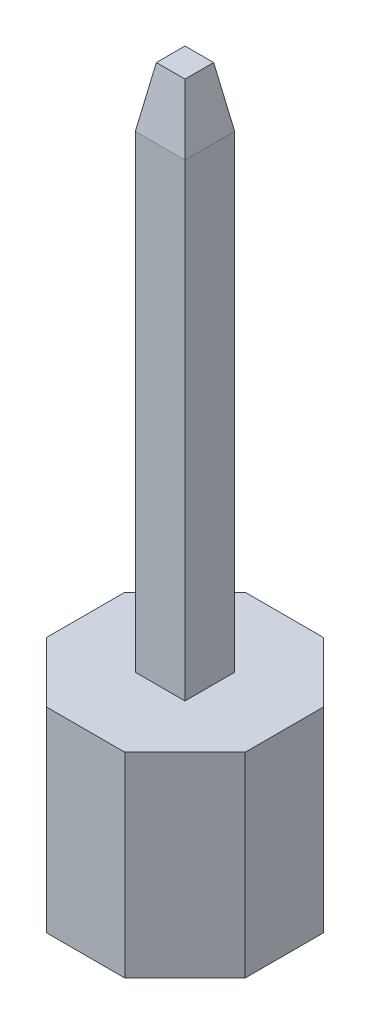
ISO-10303-21;
HEADER;
FILE_DESCRIPTION(('STEP AP214'),'2;1');
FILE_NAME('part.step','',(''),(''),'','','');
FILE_SCHEMA(('AUTOMOTIVE_DESIGN { 1 0 10303 214 1 1 1 1 }'));
ENDSEC;
DATA;
#1=APPLICATION_CONTEXT('core data for automotive mechanical design processes');
#2=APPLICATION_PROTOCOL_DEFINITION('international standard','automotive_design',2000,#1);
#3=PRODUCT_CONTEXT('',#1,'mechanical');
#4=PRODUCT('Part','Part','',(#3));
#5=PRODUCT_RELATED_PRODUCT_CATEGORY('part','',(#4));
#6=PRODUCT_DEFINITION_FORMATION('','',#4);
#7=PRODUCT_DEFINITION_CONTEXT('part definition',#1,'design');
#8=PRODUCT_DEFINITION('design','',#6,#7);
#9=PRODUCT_DEFINITION_SHAPE('','',#8);
#10=(LENGTH_UNIT() NAMED_UNIT(*) SI_UNIT(.MILLI.,.METRE.));
#11=(NAMED_UNIT(*) PLANE_ANGLE_UNIT() SI_UNIT($,.RADIAN.));
#12=(NAMED_UNIT(*) SI_UNIT($,.STERADIAN.) SOLID_ANGLE_UNIT());
#13=UNCERTAINTY_MEASURE_WITH_UNIT(LENGTH_MEASURE(1.E-05),#10,'distance_accuracy_value','');
#14=(GEOMETRIC_REPRESENTATION_CONTEXT(3) GLOBAL_UNCERTAINTY_ASSIGNED_CONTEXT((#13)) GLOBAL_UNIT_ASSIGNED_CONTEXT((#10,
#11,#12)) REPRESENTATION_CONTEXT('',''));
#15=CARTESIAN_POINT('',(0.,0.,0.));
#16=DIRECTION('',(0.,0.,1.));
#17=DIRECTION('',(1.,0.,0.));
#18=AXIS2_PLACEMENT_3D('',#15,#16,#17);
#19=CARTESIAN_POINT('',(0.3175,8.,-0.3175));
#20=DIRECTION('',(-1.,0.,0.));
#21=DIRECTION('',(0.,0.,1.));
#22=AXIS2_PLACEMENT_3D('',#19,#20,#21);
#23=PLANE('',#22);
#24=DIRECTION('',(0.,-1.,0.));
#25=VECTOR('',#24,1.);
#26=CARTESIAN_POINT('',(0.3175,8.,-0.3175));
#27=LINE('',#26,#25);
#28=CARTESIAN_POINT('',(0.3175,7.23799999999999,-0.3175));
#29=VERTEX_POINT('',#28);
#30=CARTESIAN_POINT('',(0.3175,1.25,-0.3175));
#31=VERTEX_POINT('',#30);
#32=EDGE_CURVE('E92',#29,#31,#27,.T.);
#33=ORIENTED_EDGE('',*,*,#32,.F.);
#34=DIRECTION('',(0.,0.,1.));
#35=VECTOR('',#34,1.);
#36=CARTESIAN_POINT('',(0.3175,7.23799999999999,0.3175));
#37=LINE('',#36,#35);
#38=CARTESIAN_POINT('',(0.3175,7.23799999999999,0.3175));
#39=VERTEX_POINT('',#38);
#40=EDGE_CURVE('E136',#29,#39,#37,.T.);
#41=ORIENTED_EDGE('',*,*,#40,.T.);
#42=DIRECTION('',(0.,-1.,0.));
#43=VECTOR('',#42,1.);
#44=CARTESIAN_POINT('',(0.3175,8.,0.3175));
#45=LINE('',#44,#43);
#46=CARTESIAN_POINT('',(0.3175,1.25,0.3175));
#47=VERTEX_POINT('',#46);
#48=EDGE_CURVE('E112',#39,#47,#45,.T.);
#49=ORIENTED_EDGE('',*,*,#48,.T.);
#50=DIRECTION('',(0.,0.,-1.));
#51=VECTOR('',#50,1.);
#52=CARTESIAN_POINT('',(0.3175,1.25,-0.3175));
#53=LINE('',#52,#51);
#54=EDGE_CURVE('E107',#47,#31,#53,.T.);
#55=ORIENTED_EDGE('',*,*,#54,.T.);
#56=EDGE_LOOP('',(#33,#41,#49,#55));
#57=FACE_BOUND('',#56,.T.);
#58=ADVANCED_FACE('F41',(#57),#23,.F.);
#59=CARTESIAN_POINT('',(-0.3175,8.,-0.3175));
#60=DIRECTION('',(0.,0.,1.));
#61=DIRECTION('',(1.,0.,0.));
#62=AXIS2_PLACEMENT_3D('',#59,#60,#61);
#63=PLANE('',#62);
#64=DIRECTION('',(0.,-1.,0.));
#65=VECTOR('',#64,1.);
#66=CARTESIAN_POINT('',(-0.3175,8.,-0.3175));
#67=LINE('',#66,#65);
#68=CARTESIAN_POINT('',(-0.3175,7.23799999999999,-0.3175));
#69=VERTEX_POINT('',#68);
#70=CARTESIAN_POINT('',(-0.3175,1.25,-0.3175));
#71=VERTEX_POINT('',#70);
#72=EDGE_CURVE('E101',#69,#71,#67,.T.);
#73=ORIENTED_EDGE('',*,*,#72,.F.);
#74=DIRECTION('',(1.,0.,0.));
#75=VECTOR('',#74,1.);
#76=CARTESIAN_POINT('',(0.3175,7.23799999999999,-0.3175));
#77=LINE('',#76,#75);
#78=EDGE_CURVE('E50',#69,#29,#77,.T.);
#79=ORIENTED_EDGE('',*,*,#78,.T.);
#80=ORIENTED_EDGE('',*,*,#32,.T.);
#81=DIRECTION('',(-1.,0.,0.));
#82=VECTOR('',#81,1.);
#83=CARTESIAN_POINT('',(-0.3175,1.25,-0.3175));
#84=LINE('',#83,#82);
#85=EDGE_CURVE('E95',#31,#71,#84,.T.);
#86=ORIENTED_EDGE('',*,*,#85,.T.);
#87=EDGE_LOOP('',(#73,#79,#80,#86));
#88=FACE_BOUND('',#87,.T.);
#89=ADVANCED_FACE('F94',(#88),#63,.F.);
#90=CARTESIAN_POINT('',(-0.3175,8.,-0.3175));
#91=DIRECTION('',(1.,0.,0.));
#92=DIRECTION('',(0.,0.,-1.));
#93=AXIS2_PLACEMENT_3D('',#90,#91,#92);
#94=PLANE('',#93);
#95=DIRECTION('',(0.,-1.,0.));
#96=VECTOR('',#95,1.);
#97=CARTESIAN_POINT('',(-0.3175,8.,0.3175));
#98=LINE('',#97,#96);
#99=CARTESIAN_POINT('',(-0.3175,7.23799999999999,0.3175));
#100=VERTEX_POINT('',#99);
#101=CARTESIAN_POINT('',(-0.3175,1.25,0.3175));
#102=VERTEX_POINT('',#101);
#103=EDGE_CURVE('E122',#100,#102,#98,.T.);
#104=ORIENTED_EDGE('',*,*,#103,.F.);
#105=DIRECTION('',(0.,0.,-1.));
#106=VECTOR('',#105,1.);
#107=CARTESIAN_POINT('',(-0.3175,7.23799999999999,-0.3175));
#108=LINE('',#107,#106);
#109=EDGE_CURVE('E12',#100,#69,#108,.T.);
#110=ORIENTED_EDGE('',*,*,#109,.T.);
#111=ORIENTED_EDGE('',*,*,#72,.T.);
#112=DIRECTION('',(0.,0.,1.));
#113=VECTOR('',#112,1.);
#114=CARTESIAN_POINT('',(-0.3175,1.25,-0.3175));
#115=LINE('',#114,#113);
#116=EDGE_CURVE('E109',#71,#102,#115,.T.);
#117=ORIENTED_EDGE('',*,*,#116,.T.);
#118=EDGE_LOOP('',(#104,#110,#111,#117));
#119=FACE_BOUND('',#118,.T.);
#120=ADVANCED_FACE('F161',(#119),#94,.F.);
#121=CARTESIAN_POINT('',(-0.3175,8.,0.3175));
#122=DIRECTION('',(0.,0.,-1.));
#123=DIRECTION('',(-1.,0.,0.));
#124=AXIS2_PLACEMENT_3D('',#121,#122,#123);
#125=PLANE('',#124);
#126=ORIENTED_EDGE('',*,*,#48,.F.);
#127=DIRECTION('',(-1.,0.,0.));
#128=VECTOR('',#127,1.);
#129=CARTESIAN_POINT('',(-0.3175,7.23799999999999,0.3175));
#130=LINE('',#129,#128);
#131=EDGE_CURVE('E133',#39,#100,#130,.T.);
#132=ORIENTED_EDGE('',*,*,#131,.T.);
#133=ORIENTED_EDGE('',*,*,#103,.T.);
#134=DIRECTION('',(1.,0.,0.));
#135=VECTOR('',#134,1.);
#136=CARTESIAN_POINT('',(-0.3175,1.25,0.3175));
#137=LINE('',#136,#135);
#138=EDGE_CURVE('E119',#102,#47,#137,.T.);
#139=ORIENTED_EDGE('',*,*,#138,.T.);
#140=EDGE_LOOP('',(#126,#132,#133,#139));
#141=FACE_BOUND('',#140,.T.);
#142=ADVANCED_FACE('F160',(#141),#125,.F.);
#143=CARTESIAN_POINT('',(0.3175,8.,0.3175));
#144=DIRECTION('',(0.,1.,0.));
#145=DIRECTION('',(0.,0.,1.));
#146=AXIS2_PLACEMENT_3D('',#143,#144,#145);
#147=PLANE('',#146);
#148=DIRECTION('',(0.,0.,1.));
#149=VECTOR('',#148,1.);
#150=CARTESIAN_POINT('',(-0.18313884070015,8.,0.3175));
#151=LINE('',#150,#149);
#152=CARTESIAN_POINT('',(-0.18313884070015,8.,-0.183138840700149));
#153=VERTEX_POINT('',#152);
#154=CARTESIAN_POINT('',(-0.18313884070015,8.,0.18313884070015));
#155=VERTEX_POINT('',#154);
#156=EDGE_CURVE('E100',#153,#155,#151,.T.);
#157=ORIENTED_EDGE('',*,*,#156,.T.);
#158=DIRECTION('',(1.,0.,0.));
#159=VECTOR('',#158,1.);
#160=CARTESIAN_POINT('',(0.3175,8.,0.18313884070015));
#161=LINE('',#160,#159);
#162=CARTESIAN_POINT('',(0.18313884070015,8.,0.18313884070015));
#163=VERTEX_POINT('',#162);
#164=EDGE_CURVE('E130',#155,#163,#161,.T.);
#165=ORIENTED_EDGE('',*,*,#164,.T.);
#166=DIRECTION('',(0.,0.,-1.));
#167=VECTOR('',#166,1.);
#168=CARTESIAN_POINT('',(0.18313884070015,8.,-0.3175));
#169=LINE('',#168,#167);
#170=CARTESIAN_POINT('',(0.18313884070015,8.,-0.183138840700149));
#171=VERTEX_POINT('',#170);
#172=EDGE_CURVE('E128',#163,#171,#169,.T.);
#173=ORIENTED_EDGE('',*,*,#172,.T.);
#174=DIRECTION('',(-1.,0.,0.));
#175=VECTOR('',#174,1.);
#176=CARTESIAN_POINT('',(-0.3175,8.,-0.183138840700149));
#177=LINE('',#176,#175);
#178=EDGE_CURVE('E126',#171,#153,#177,.T.);
#179=ORIENTED_EDGE('',*,*,#178,.T.);
#180=EDGE_LOOP('',(#157,#165,#173,#179));
#181=FACE_BOUND('',#180,.T.);
#182=ADVANCED_FACE('F153',(#181),#147,.T.);
#183=CARTESIAN_POINT('',(0.3175,1.25,0.3175));
#184=DIRECTION('',(0.,1.,0.));
#185=DIRECTION('',(0.,0.,1.));
#186=AXIS2_PLACEMENT_3D('',#183,#184,#185);
#187=PLANE('',#186);
#188=ORIENTED_EDGE('',*,*,#54,.F.);
#189=ORIENTED_EDGE('',*,*,#138,.F.);
#190=ORIENTED_EDGE('',*,*,#116,.F.);
#191=ORIENTED_EDGE('',*,*,#85,.F.);
#192=EDGE_LOOP('',(#188,#189,#190,#191));
#193=FACE_BOUND('',#192,.T.);
#194=ADVANCED_FACE('F105',(#193),#187,.F.);
#195=CARTESIAN_POINT('',(0.3175,8.,-0.183138840700149));
#196=DIRECTION('',(0.,0.173648177666927,-0.984807753012209));
#197=DIRECTION('',(0.,0.984807753012209,0.173648177666927));
#198=AXIS2_PLACEMENT_3D('',#195,#196,#197);
#199=PLANE('',#198);
#200=DIRECTION('',(0.171087869746033,-0.970287525247815,-0.171087869746033));
#201=VECTOR('',#200,1.);
#202=CARTESIAN_POINT('',(0.187071734144734,7.97769545290923,-0.187071734144734));
#203=LINE('',#202,#201);
#204=EDGE_CURVE('E116',#29,#171,#203,.F.);
#205=ORIENTED_EDGE('',*,*,#204,.F.);
#206=ORIENTED_EDGE('',*,*,#78,.F.);
#207=DIRECTION('',(-0.171087869746033,-0.970287525247815,-0.171087869746033));
#208=VECTOR('',#207,1.);
#209=CARTESIAN_POINT('',(-0.168484611569095,8.08310826325146,-0.168484611569094));
#210=LINE('',#209,#208);
#211=EDGE_CURVE('E45',#153,#69,#210,.T.);
#212=ORIENTED_EDGE('',*,*,#211,.F.);
#213=ORIENTED_EDGE('',*,*,#178,.F.);
#214=EDGE_LOOP('',(#205,#206,#212,#213));
#215=FACE_BOUND('',#214,.T.);
#216=ADVANCED_FACE('F43',(#215),#199,.T.);
#217=CARTESIAN_POINT('',(-0.18313884070015,8.,0.3175));
#218=DIRECTION('',(-0.984807753012209,0.173648177666927,0.));
#219=DIRECTION('',(-0.173648177666927,-0.984807753012209,0.));
#220=AXIS2_PLACEMENT_3D('',#217,#218,#219);
#221=PLANE('',#220);
#222=ORIENTED_EDGE('',*,*,#211,.T.);
#223=ORIENTED_EDGE('',*,*,#109,.F.);
#224=DIRECTION('',(0.171087869746033,0.970287525247815,-0.171087869746033));
#225=VECTOR('',#224,1.);
#226=CARTESIAN_POINT('',(-0.187071734144734,7.97769545290923,0.187071734144735));
#227=LINE('',#226,#225);
#228=EDGE_CURVE('E141',#155,#100,#227,.F.);
#229=ORIENTED_EDGE('',*,*,#228,.F.);
#230=ORIENTED_EDGE('',*,*,#156,.F.);
#231=EDGE_LOOP('',(#222,#223,#229,#230));
#232=FACE_BOUND('',#231,.T.);
#233=ADVANCED_FACE('F178',(#232),#221,.T.);
#234=CARTESIAN_POINT('',(0.18313884070015,8.,0.3175));
#235=DIRECTION('',(0.984807753012209,0.173648177666927,0.));
#236=DIRECTION('',(-0.173648177666927,0.984807753012209,0.));
#237=AXIS2_PLACEMENT_3D('',#234,#235,#236);
#238=PLANE('',#237);
#239=ORIENTED_EDGE('',*,*,#204,.T.);
#240=ORIENTED_EDGE('',*,*,#172,.F.);
#241=DIRECTION('',(0.171087869746033,-0.970287525247815,0.171087869746033));
#242=VECTOR('',#241,1.);
#243=CARTESIAN_POINT('',(0.187071734144734,7.97769545290923,0.187071734144735));
#244=LINE('',#243,#242);
#245=EDGE_CURVE('E139',#39,#163,#244,.F.);
#246=ORIENTED_EDGE('',*,*,#245,.F.);
#247=ORIENTED_EDGE('',*,*,#40,.F.);
#248=EDGE_LOOP('',(#239,#240,#246,#247));
#249=FACE_BOUND('',#248,.T.);
#250=ADVANCED_FACE('F146',(#249),#238,.T.);
#251=CARTESIAN_POINT('',(0.3175,8.,0.18313884070015));
#252=DIRECTION('',(0.,0.173648177666927,0.984807753012209));
#253=DIRECTION('',(0.,-0.984807753012209,0.173648177666927));
#254=AXIS2_PLACEMENT_3D('',#251,#252,#253);
#255=PLANE('',#254);
#256=ORIENTED_EDGE('',*,*,#228,.T.);
#257=ORIENTED_EDGE('',*,*,#131,.F.);
#258=ORIENTED_EDGE('',*,*,#245,.T.);
#259=ORIENTED_EDGE('',*,*,#164,.F.);
#260=EDGE_LOOP('',(#256,#257,#258,#259));
#261=FACE_BOUND('',#260,.T.);
#262=ADVANCED_FACE('F157',(#261),#255,.T.);
#263=CLOSED_SHELL('',(#58,#89,#120,#142,#182,#194,#216,#233,#250,#262));
#264=MANIFOLD_SOLID_BREP('B2',#263);
#265=CARTESIAN_POINT('',(1.27,1.25,-1.27));
#266=DIRECTION('',(0.,-1.,0.));
#267=DIRECTION('',(0.,0.,-1.));
#268=AXIS2_PLACEMENT_3D('',#265,#266,#267);
#269=PLANE('',#268);
#270=DIRECTION('',(-1.,0.,0.));
#271=VECTOR('',#270,1.);
#272=CARTESIAN_POINT('',(-0.5,1.25,-1.27));
#273=LINE('',#272,#271);
#274=CARTESIAN_POINT('',(0.5,1.25,-1.27));
#275=VERTEX_POINT('',#274);
#276=CARTESIAN_POINT('',(-0.5,1.25,-1.27));
#277=VERTEX_POINT('',#276);
#278=EDGE_CURVE('E357',#275,#277,#273,.T.);
#279=ORIENTED_EDGE('',*,*,#278,.T.);
#280=DIRECTION('',(-0.707106781186541,0.,0.707106781186554));
#281=VECTOR('',#280,1.);
#282=CARTESIAN_POINT('',(-0.5,1.25,-1.27));
#283=LINE('',#282,#281);
#284=CARTESIAN_POINT('',(-1.27,1.25,-0.499999999999987));
#285=VERTEX_POINT('',#284);
#286=EDGE_CURVE('E305',#277,#285,#283,.T.);
#287=ORIENTED_EDGE('',*,*,#286,.T.);
#288=DIRECTION('',(0.,0.,1.));
#289=VECTOR('',#288,1.);
#290=CARTESIAN_POINT('',(-1.27,1.25,-0.499999999999987));
#291=LINE('',#290,#289);
#292=CARTESIAN_POINT('',(-1.27,1.25,0.499999999999987));
#293=VERTEX_POINT('',#292);
#294=EDGE_CURVE('E372',#285,#293,#291,.T.);
#295=ORIENTED_EDGE('',*,*,#294,.T.);
#296=DIRECTION('',(0.707106781186541,0.,0.707106781186554));
#297=VECTOR('',#296,1.);
#298=CARTESIAN_POINT('',(-0.5,1.25,1.27));
#299=LINE('',#298,#297);
#300=CARTESIAN_POINT('',(-0.5,1.25,1.27));
#301=VERTEX_POINT('',#300);
#302=EDGE_CURVE('E385',#293,#301,#299,.T.);
#303=ORIENTED_EDGE('',*,*,#302,.T.);
#304=DIRECTION('',(1.,0.,0.));
#305=VECTOR('',#304,1.);
#306=CARTESIAN_POINT('',(-0.5,1.25,1.27));
#307=LINE('',#306,#305);
#308=CARTESIAN_POINT('',(0.5,1.25,1.27));
#309=VERTEX_POINT('',#308);
#310=EDGE_CURVE('E324',#301,#309,#307,.T.);
#311=ORIENTED_EDGE('',*,*,#310,.T.);
#312=DIRECTION('',(0.707106781186541,0.,-0.707106781186554));
#313=VECTOR('',#312,1.);
#314=CARTESIAN_POINT('',(0.5,1.25,1.27));
#315=LINE('',#314,#313);
#316=CARTESIAN_POINT('',(1.27,1.25,0.499999999999987));
#317=VERTEX_POINT('',#316);
#318=EDGE_CURVE('E318',#309,#317,#315,.T.);
#319=ORIENTED_EDGE('',*,*,#318,.T.);
#320=DIRECTION('',(0.,0.,-1.));
#321=VECTOR('',#320,1.);
#322=CARTESIAN_POINT('',(1.27,1.25,-0.499999999999987));
#323=LINE('',#322,#321);
#324=CARTESIAN_POINT('',(1.27,1.25,-0.499999999999987));
#325=VERTEX_POINT('',#324);
#326=EDGE_CURVE('E322',#317,#325,#323,.T.);
#327=ORIENTED_EDGE('',*,*,#326,.T.);
#328=DIRECTION('',(-0.707106781186541,0.,-0.707106781186554));
#329=VECTOR('',#328,1.);
#330=CARTESIAN_POINT('',(0.5,1.25,-1.27));
#331=LINE('',#330,#329);
#332=EDGE_CURVE('E262',#325,#275,#331,.T.);
#333=ORIENTED_EDGE('',*,*,#332,.T.);
#334=EDGE_LOOP('',(#279,#287,#295,#303,#311,#319,#327,#333));
#335=FACE_BOUND('',#334,.T.);
#336=CARTESIAN_POINT('',(0.,1.25,0.));
#337=DIRECTION('',(0.,1.,0.));
#338=DIRECTION('',(0.,0.,1.));
#339=AXIS2_PLACEMENT_3D('',#336,#337,#338);
#340=CIRCLE('',#339,0.3175);
#341=CARTESIAN_POINT('',(0.,1.25,0.3175));
#342=VERTEX_POINT('',#341);
#343=EDGE_CURVE('E346',#342,#342,#340,.T.);
#344=ORIENTED_EDGE('',*,*,#343,.F.);
#345=EDGE_LOOP('',(#344));
#346=FACE_BOUND('',#345,.T.);
#347=ADVANCED_FACE('F245',(#335,#346),#269,.F.);
#348=CARTESIAN_POINT('',(1.27,-1.25,-1.27));
#349=DIRECTION('',(0.,-1.,0.));
#350=DIRECTION('',(0.,0.,-1.));
#351=AXIS2_PLACEMENT_3D('',#348,#349,#350);
#352=PLANE('',#351);
#353=DIRECTION('',(-1.,0.,0.));
#354=VECTOR('',#353,1.);
#355=CARTESIAN_POINT('',(-0.5,-1.25,-1.27));
#356=LINE('',#355,#354);
#357=CARTESIAN_POINT('',(0.5,-1.25,-1.27));
#358=VERTEX_POINT('',#357);
#359=CARTESIAN_POINT('',(-0.5,-1.25,-1.27));
#360=VERTEX_POINT('',#359);
#361=EDGE_CURVE('E342',#358,#360,#356,.T.);
#362=ORIENTED_EDGE('',*,*,#361,.F.);
#363=DIRECTION('',(-0.707106781186541,0.,-0.707106781186554));
#364=VECTOR('',#363,1.);
#365=CARTESIAN_POINT('',(0.5,-1.25,-1.27));
#366=LINE('',#365,#364);
#367=CARTESIAN_POINT('',(1.27,-1.25,-0.499999999999987));
#368=VERTEX_POINT('',#367);
#369=EDGE_CURVE('E297',#368,#358,#366,.T.);
#370=ORIENTED_EDGE('',*,*,#369,.F.);
#371=DIRECTION('',(0.,0.,-1.));
#372=VECTOR('',#371,1.);
#373=CARTESIAN_POINT('',(1.27,-1.25,-0.499999999999987));
#374=LINE('',#373,#372);
#375=CARTESIAN_POINT('',(1.27,-1.25,0.499999999999987));
#376=VERTEX_POINT('',#375);
#377=EDGE_CURVE('E291',#376,#368,#374,.T.);
#378=ORIENTED_EDGE('',*,*,#377,.F.);
#379=DIRECTION('',(0.707106781186541,0.,-0.707106781186554));
#380=VECTOR('',#379,1.);
#381=CARTESIAN_POINT('',(0.5,-1.25,1.27));
#382=LINE('',#381,#380);
#383=CARTESIAN_POINT('',(0.5,-1.25,1.27));
#384=VERTEX_POINT('',#383);
#385=EDGE_CURVE('E332',#384,#376,#382,.T.);
#386=ORIENTED_EDGE('',*,*,#385,.F.);
#387=DIRECTION('',(1.,0.,0.));
#388=VECTOR('',#387,1.);
#389=CARTESIAN_POINT('',(-0.5,-1.25,1.27));
#390=LINE('',#389,#388);
#391=CARTESIAN_POINT('',(-0.5,-1.25,1.27));
#392=VERTEX_POINT('',#391);
#393=EDGE_CURVE('E352',#392,#384,#390,.T.);
#394=ORIENTED_EDGE('',*,*,#393,.F.);
#395=DIRECTION('',(0.707106781186541,0.,0.707106781186554));
#396=VECTOR('',#395,1.);
#397=CARTESIAN_POINT('',(-0.5,-1.25,1.27));
#398=LINE('',#397,#396);
#399=CARTESIAN_POINT('',(-1.27,-1.25,0.499999999999987));
#400=VERTEX_POINT('',#399);
#401=EDGE_CURVE('E350',#400,#392,#398,.T.);
#402=ORIENTED_EDGE('',*,*,#401,.F.);
#403=DIRECTION('',(0.,0.,1.));
#404=VECTOR('',#403,1.);
#405=CARTESIAN_POINT('',(-1.27,-1.25,-0.499999999999987));
#406=LINE('',#405,#404);
#407=CARTESIAN_POINT('',(-1.27,-1.25,-0.499999999999987));
#408=VERTEX_POINT('',#407);
#409=EDGE_CURVE('E348',#408,#400,#406,.T.);
#410=ORIENTED_EDGE('',*,*,#409,.F.);
#411=DIRECTION('',(-0.707106781186541,0.,0.707106781186554));
#412=VECTOR('',#411,1.);
#413=CARTESIAN_POINT('',(-0.5,-1.25,-1.27));
#414=LINE('',#413,#412);
#415=EDGE_CURVE('E345',#360,#408,#414,.T.);
#416=ORIENTED_EDGE('',*,*,#415,.F.);
#417=EDGE_LOOP('',(#362,#370,#378,#386,#394,#402,#410,#416));
#418=FACE_BOUND('',#417,.T.);
#419=CARTESIAN_POINT('',(0.,-1.25,0.));
#420=DIRECTION('',(0.,1.,0.));
#421=DIRECTION('',(0.,0.,1.));
#422=AXIS2_PLACEMENT_3D('',#419,#420,#421);
#423=CIRCLE('',#422,0.3175);
#424=CARTESIAN_POINT('',(0.,-1.25,0.3175));
#425=VERTEX_POINT('',#424);
#426=EDGE_CURVE('E391',#425,#425,#423,.T.);
#427=ORIENTED_EDGE('',*,*,#426,.T.);
#428=EDGE_LOOP('',(#427));
#429=FACE_BOUND('',#428,.T.);
#430=ADVANCED_FACE('F376',(#418,#429),#352,.T.);
#431=CARTESIAN_POINT('',(-0.5,1.25,-1.27));
#432=DIRECTION('',(0.,0.,1.));
#433=DIRECTION('',(1.,0.,0.));
#434=AXIS2_PLACEMENT_3D('',#431,#432,#433);
#435=PLANE('',#434);
#436=ORIENTED_EDGE('',*,*,#361,.T.);
#437=DIRECTION('',(0.,-1.,0.));
#438=VECTOR('',#437,1.);
#439=CARTESIAN_POINT('',(-0.5,1.25,-1.27));
#440=LINE('',#439,#438);
#441=EDGE_CURVE('E39',#277,#360,#440,.T.);
#442=ORIENTED_EDGE('',*,*,#441,.F.);
#443=ORIENTED_EDGE('',*,*,#278,.F.);
#444=DIRECTION('',(0.,-1.,0.));
#445=VECTOR('',#444,1.);
#446=CARTESIAN_POINT('',(0.5,1.25,-1.27));
#447=LINE('',#446,#445);
#448=EDGE_CURVE('E338',#275,#358,#447,.T.);
#449=ORIENTED_EDGE('',*,*,#448,.T.);
#450=EDGE_LOOP('',(#436,#442,#443,#449));
#451=FACE_BOUND('',#450,.T.);
#452=ADVANCED_FACE('F247',(#451),#435,.F.);
#453=CARTESIAN_POINT('',(-0.5,1.25,-1.27));
#454=DIRECTION('',(0.707106781186554,0.,0.707106781186541));
#455=DIRECTION('',(0.707106781186541,0.,-0.707106781186554));
#456=AXIS2_PLACEMENT_3D('',#453,#454,#455);
#457=PLANE('',#456);
#458=ORIENTED_EDGE('',*,*,#415,.T.);
#459=DIRECTION('',(0.,-1.,0.));
#460=VECTOR('',#459,1.);
#461=CARTESIAN_POINT('',(-1.27,1.25,-0.499999999999987));
#462=LINE('',#461,#460);
#463=EDGE_CURVE('E254',#285,#408,#462,.T.);
#464=ORIENTED_EDGE('',*,*,#463,.F.);
#465=ORIENTED_EDGE('',*,*,#286,.F.);
#466=ORIENTED_EDGE('',*,*,#441,.T.);
#467=EDGE_LOOP('',(#458,#464,#465,#466));
#468=FACE_BOUND('',#467,.T.);
#469=ADVANCED_FACE('F419',(#468),#457,.F.);
#470=CARTESIAN_POINT('',(-1.27,1.25,-0.499999999999987));
#471=DIRECTION('',(1.,0.,0.));
#472=DIRECTION('',(0.,0.,-1.));
#473=AXIS2_PLACEMENT_3D('',#470,#471,#472);
#474=PLANE('',#473);
#475=ORIENTED_EDGE('',*,*,#409,.T.);
#476=DIRECTION('',(0.,-1.,0.));
#477=VECTOR('',#476,1.);
#478=CARTESIAN_POINT('',(-1.27,1.25,0.499999999999987));
#479=LINE('',#478,#477);
#480=EDGE_CURVE('E364',#293,#400,#479,.T.);
#481=ORIENTED_EDGE('',*,*,#480,.F.);
#482=ORIENTED_EDGE('',*,*,#294,.F.);
#483=ORIENTED_EDGE('',*,*,#463,.T.);
#484=EDGE_LOOP('',(#475,#481,#482,#483));
#485=FACE_BOUND('',#484,.T.);
#486=ADVANCED_FACE('F370',(#485),#474,.F.);
#487=CARTESIAN_POINT('',(-0.5,1.25,1.27));
#488=DIRECTION('',(0.707106781186554,0.,-0.707106781186541));
#489=DIRECTION('',(-0.707106781186541,0.,-0.707106781186554));
#490=AXIS2_PLACEMENT_3D('',#487,#488,#489);
#491=PLANE('',#490);
#492=ORIENTED_EDGE('',*,*,#401,.T.);
#493=DIRECTION('',(0.,-1.,0.));
#494=VECTOR('',#493,1.);
#495=CARTESIAN_POINT('',(-0.5,1.25,1.27));
#496=LINE('',#495,#494);
#497=EDGE_CURVE('E361',#301,#392,#496,.T.);
#498=ORIENTED_EDGE('',*,*,#497,.F.);
#499=ORIENTED_EDGE('',*,*,#302,.F.);
#500=ORIENTED_EDGE('',*,*,#480,.T.);
#501=EDGE_LOOP('',(#492,#498,#499,#500));
#502=FACE_BOUND('',#501,.T.);
#503=ADVANCED_FACE('F381',(#502),#491,.F.);
#504=CARTESIAN_POINT('',(-0.5,1.25,1.27));
#505=DIRECTION('',(0.,0.,-1.));
#506=DIRECTION('',(-1.,0.,0.));
#507=AXIS2_PLACEMENT_3D('',#504,#505,#506);
#508=PLANE('',#507);
#509=ORIENTED_EDGE('',*,*,#393,.T.);
#510=DIRECTION('',(0.,-1.,0.));
#511=VECTOR('',#510,1.);
#512=CARTESIAN_POINT('',(0.5,1.25,1.27));
#513=LINE('',#512,#511);
#514=EDGE_CURVE('E333',#309,#384,#513,.T.);
#515=ORIENTED_EDGE('',*,*,#514,.F.);
#516=ORIENTED_EDGE('',*,*,#310,.F.);
#517=ORIENTED_EDGE('',*,*,#497,.T.);
#518=EDGE_LOOP('',(#509,#515,#516,#517));
#519=FACE_BOUND('',#518,.T.);
#520=ADVANCED_FACE('F384',(#519),#508,.F.);
#521=CARTESIAN_POINT('',(0.5,1.25,1.27));
#522=DIRECTION('',(-0.707106781186554,0.,-0.707106781186541));
#523=DIRECTION('',(-0.707106781186541,0.,0.707106781186554));
#524=AXIS2_PLACEMENT_3D('',#521,#522,#523);
#525=PLANE('',#524);
#526=ORIENTED_EDGE('',*,*,#385,.T.);
#527=DIRECTION('',(0.,-1.,0.));
#528=VECTOR('',#527,1.);
#529=CARTESIAN_POINT('',(1.27,1.25,0.499999999999987));
#530=LINE('',#529,#528);
#531=EDGE_CURVE('E329',#317,#376,#530,.T.);
#532=ORIENTED_EDGE('',*,*,#531,.F.);
#533=ORIENTED_EDGE('',*,*,#318,.F.);
#534=ORIENTED_EDGE('',*,*,#514,.T.);
#535=EDGE_LOOP('',(#526,#532,#533,#534));
#536=FACE_BOUND('',#535,.T.);
#537=ADVANCED_FACE('F330',(#536),#525,.F.);
#538=CARTESIAN_POINT('',(1.27,1.25,-0.499999999999987));
#539=DIRECTION('',(-1.,0.,0.));
#540=DIRECTION('',(0.,0.,1.));
#541=AXIS2_PLACEMENT_3D('',#538,#539,#540);
#542=PLANE('',#541);
#543=ORIENTED_EDGE('',*,*,#377,.T.);
#544=DIRECTION('',(0.,-1.,0.));
#545=VECTOR('',#544,1.);
#546=CARTESIAN_POINT('',(1.27,1.25,-0.499999999999987));
#547=LINE('',#546,#545);
#548=EDGE_CURVE('E334',#325,#368,#547,.T.);
#549=ORIENTED_EDGE('',*,*,#548,.F.);
#550=ORIENTED_EDGE('',*,*,#326,.F.);
#551=ORIENTED_EDGE('',*,*,#531,.T.);
#552=EDGE_LOOP('',(#543,#549,#550,#551));
#553=FACE_BOUND('',#552,.T.);
#554=ADVANCED_FACE('F336',(#553),#542,.F.);
#555=CARTESIAN_POINT('',(0.5,1.25,-1.27));
#556=DIRECTION('',(-0.707106781186554,0.,0.707106781186541));
#557=DIRECTION('',(0.707106781186541,0.,0.707106781186554));
#558=AXIS2_PLACEMENT_3D('',#555,#556,#557);
#559=PLANE('',#558);
#560=ORIENTED_EDGE('',*,*,#369,.T.);
#561=ORIENTED_EDGE('',*,*,#448,.F.);
#562=ORIENTED_EDGE('',*,*,#332,.F.);
#563=ORIENTED_EDGE('',*,*,#548,.T.);
#564=EDGE_LOOP('',(#560,#561,#562,#563));
#565=FACE_BOUND('',#564,.T.);
#566=ADVANCED_FACE('F407',(#565),#559,.F.);
#567=CARTESIAN_POINT('',(0.,1.25,0.));
#568=DIRECTION('',(0.,-1.,0.));
#569=DIRECTION('',(0.,0.,-1.));
#570=AXIS2_PLACEMENT_3D('',#567,#568,#569);
#571=CYLINDRICAL_SURFACE('',#570,0.3175);
#572=ORIENTED_EDGE('',*,*,#343,.T.);
#573=EDGE_LOOP('',(#572));
#574=FACE_BOUND('',#573,.T.);
#575=ORIENTED_EDGE('',*,*,#426,.F.);
#576=EDGE_LOOP('',(#575));
#577=FACE_BOUND('',#576,.T.);
#578=ADVANCED_FACE('F397',(#574,#577),#571,.F.);
#579=CLOSED_SHELL('',(#347,#430,#452,#469,#486,#503,#520,#537,#554,#566,#578));
#580=MANIFOLD_SOLID_BREP('B6',#579);
#581=ADVANCED_BREP_SHAPE_REPRESENTATION('',(#18,#264,#580),#14);
#582=SHAPE_DEFINITION_REPRESENTATION(#9,#581);
ENDSEC;
END-ISO-10303-21;
